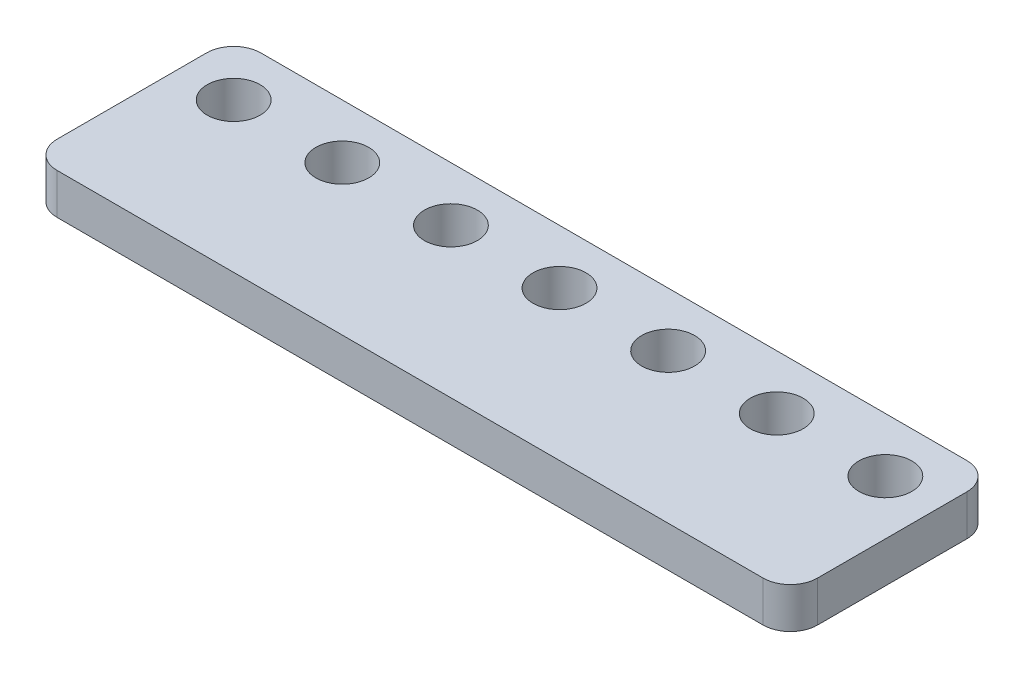
ISO-10303-21;
HEADER;
FILE_DESCRIPTION(('STEP AP214'),'2;1');
FILE_NAME('part.step','',(''),(''),'','','');
FILE_SCHEMA(('AUTOMOTIVE_DESIGN { 1 0 10303 214 1 1 1 1 }'));
ENDSEC;
DATA;
#1=APPLICATION_CONTEXT('core data for automotive mechanical design processes');
#2=APPLICATION_PROTOCOL_DEFINITION('international standard','automotive_design',2000,#1);
#3=PRODUCT_CONTEXT('',#1,'mechanical');
#4=PRODUCT('Part','Part','',(#3));
#5=PRODUCT_RELATED_PRODUCT_CATEGORY('part','',(#4));
#6=PRODUCT_DEFINITION_FORMATION('','',#4);
#7=PRODUCT_DEFINITION_CONTEXT('part definition',#1,'design');
#8=PRODUCT_DEFINITION('design','',#6,#7);
#9=PRODUCT_DEFINITION_SHAPE('','',#8);
#10=(LENGTH_UNIT() NAMED_UNIT(*) SI_UNIT(.MILLI.,.METRE.));
#11=(NAMED_UNIT(*) PLANE_ANGLE_UNIT() SI_UNIT($,.RADIAN.));
#12=(NAMED_UNIT(*) SI_UNIT($,.STERADIAN.) SOLID_ANGLE_UNIT());
#13=UNCERTAINTY_MEASURE_WITH_UNIT(LENGTH_MEASURE(1.E-05),#10,'distance_accuracy_value','');
#14=(GEOMETRIC_REPRESENTATION_CONTEXT(3) GLOBAL_UNCERTAINTY_ASSIGNED_CONTEXT((#13)) GLOBAL_UNIT_ASSIGNED_CONTEXT((#10,
#11,#12)) REPRESENTATION_CONTEXT('',''));
#15=CARTESIAN_POINT('',(0.,0.,0.));
#16=DIRECTION('',(0.,0.,1.));
#17=DIRECTION('',(1.,0.,0.));
#18=AXIS2_PLACEMENT_3D('',#15,#16,#17);
#19=CARTESIAN_POINT('',(-2.,3.,13.));
#20=DIRECTION('',(0.,-1.,0.));
#21=DIRECTION('',(0.,0.,-1.));
#22=AXIS2_PLACEMENT_3D('',#19,#20,#21);
#23=CYLINDRICAL_SURFACE('',#22,2.);
#24=CARTESIAN_POINT('',(-2.,0.,13.));
#25=DIRECTION('',(0.,1.,0.));
#26=DIRECTION('',(0.,0.,1.));
#27=AXIS2_PLACEMENT_3D('',#24,#25,#26);
#28=CIRCLE('',#27,2.);
#29=CARTESIAN_POINT('',(-2.,0.,15.));
#30=VERTEX_POINT('',#29);
#31=CARTESIAN_POINT('',(0.,0.,13.));
#32=VERTEX_POINT('',#31);
#33=EDGE_CURVE('E128',#30,#32,#28,.T.);
#34=ORIENTED_EDGE('',*,*,#33,.T.);
#35=DIRECTION('',(0.,-1.,0.));
#36=VECTOR('',#35,1.);
#37=CARTESIAN_POINT('',(0.,3.,13.));
#38=LINE('',#37,#36);
#39=CARTESIAN_POINT('',(0.,3.,13.));
#40=VERTEX_POINT('',#39);
#41=EDGE_CURVE('E11',#40,#32,#38,.T.);
#42=ORIENTED_EDGE('',*,*,#41,.F.);
#43=CARTESIAN_POINT('',(-2.,3.,13.));
#44=DIRECTION('',(0.,1.,0.));
#45=DIRECTION('',(0.,0.,1.));
#46=AXIS2_PLACEMENT_3D('',#43,#44,#45);
#47=CIRCLE('',#46,2.);
#48=CARTESIAN_POINT('',(-2.,3.,15.));
#49=VERTEX_POINT('',#48);
#50=EDGE_CURVE('E143',#49,#40,#47,.T.);
#51=ORIENTED_EDGE('',*,*,#50,.F.);
#52=DIRECTION('',(0.,-1.,0.));
#53=VECTOR('',#52,1.);
#54=CARTESIAN_POINT('',(-2.,3.,15.));
#55=LINE('',#54,#53);
#56=EDGE_CURVE('E124',#49,#30,#55,.T.);
#57=ORIENTED_EDGE('',*,*,#56,.T.);
#58=EDGE_LOOP('',(#34,#42,#51,#57));
#59=FACE_BOUND('',#58,.T.);
#60=ADVANCED_FACE('F32',(#59),#23,.T.);
#61=CARTESIAN_POINT('',(0.,3.,2.));
#62=DIRECTION('',(-1.,0.,0.));
#63=DIRECTION('',(0.,0.,1.));
#64=AXIS2_PLACEMENT_3D('',#61,#62,#63);
#65=PLANE('',#64);
#66=DIRECTION('',(0.,0.,-1.));
#67=VECTOR('',#66,1.);
#68=CARTESIAN_POINT('',(0.,0.,2.));
#69=LINE('',#68,#67);
#70=CARTESIAN_POINT('',(0.,0.,2.));
#71=VERTEX_POINT('',#70);
#72=EDGE_CURVE('E131',#32,#71,#69,.T.);
#73=ORIENTED_EDGE('',*,*,#72,.T.);
#74=DIRECTION('',(0.,-1.,0.));
#75=VECTOR('',#74,1.);
#76=CARTESIAN_POINT('',(0.,3.,2.));
#77=LINE('',#76,#75);
#78=CARTESIAN_POINT('',(0.,3.,2.));
#79=VERTEX_POINT('',#78);
#80=EDGE_CURVE('E40',#79,#71,#77,.T.);
#81=ORIENTED_EDGE('',*,*,#80,.F.);
#82=DIRECTION('',(0.,0.,-1.));
#83=VECTOR('',#82,1.);
#84=CARTESIAN_POINT('',(0.,3.,2.));
#85=LINE('',#84,#83);
#86=EDGE_CURVE('E91',#40,#79,#85,.T.);
#87=ORIENTED_EDGE('',*,*,#86,.F.);
#88=ORIENTED_EDGE('',*,*,#41,.T.);
#89=EDGE_LOOP('',(#73,#81,#87,#88));
#90=FACE_BOUND('',#89,.T.);
#91=ADVANCED_FACE('F259',(#90),#65,.F.);
#92=CARTESIAN_POINT('',(-2.,3.,2.));
#93=DIRECTION('',(0.,-1.,0.));
#94=DIRECTION('',(0.,0.,-1.));
#95=AXIS2_PLACEMENT_3D('',#92,#93,#94);
#96=CYLINDRICAL_SURFACE('',#95,2.);
#97=CARTESIAN_POINT('',(-2.,0.,2.));
#98=DIRECTION('',(0.,1.,0.));
#99=DIRECTION('',(0.,0.,-1.));
#100=AXIS2_PLACEMENT_3D('',#97,#98,#99);
#101=CIRCLE('',#100,2.);
#102=CARTESIAN_POINT('',(-2.,0.,0.));
#103=VERTEX_POINT('',#102);
#104=EDGE_CURVE('E134',#71,#103,#101,.T.);
#105=ORIENTED_EDGE('',*,*,#104,.T.);
#106=DIRECTION('',(0.,-1.,0.));
#107=VECTOR('',#106,1.);
#108=CARTESIAN_POINT('',(-2.,3.,0.));
#109=LINE('',#108,#107);
#110=CARTESIAN_POINT('',(-2.,3.,0.));
#111=VERTEX_POINT('',#110);
#112=EDGE_CURVE('E150',#111,#103,#109,.T.);
#113=ORIENTED_EDGE('',*,*,#112,.F.);
#114=CARTESIAN_POINT('',(-2.,3.,2.));
#115=DIRECTION('',(0.,1.,0.));
#116=DIRECTION('',(0.,0.,-1.));
#117=AXIS2_PLACEMENT_3D('',#114,#115,#116);
#118=CIRCLE('',#117,2.);
#119=EDGE_CURVE('E158',#79,#111,#118,.T.);
#120=ORIENTED_EDGE('',*,*,#119,.F.);
#121=ORIENTED_EDGE('',*,*,#80,.T.);
#122=EDGE_LOOP('',(#105,#113,#120,#121));
#123=FACE_BOUND('',#122,.T.);
#124=ADVANCED_FACE('F156',(#123),#96,.T.);
#125=CARTESIAN_POINT('',(-54.,3.,0.));
#126=DIRECTION('',(0.,0.,1.));
#127=DIRECTION('',(1.,0.,0.));
#128=AXIS2_PLACEMENT_3D('',#125,#126,#127);
#129=PLANE('',#128);
#130=DIRECTION('',(-1.,0.,0.));
#131=VECTOR('',#130,1.);
#132=CARTESIAN_POINT('',(-54.,0.,0.));
#133=LINE('',#132,#131);
#134=CARTESIAN_POINT('',(-54.,0.,0.));
#135=VERTEX_POINT('',#134);
#136=EDGE_CURVE('E136',#103,#135,#133,.T.);
#137=ORIENTED_EDGE('',*,*,#136,.T.);
#138=DIRECTION('',(0.,-1.,0.));
#139=VECTOR('',#138,1.);
#140=CARTESIAN_POINT('',(-54.,3.,0.));
#141=LINE('',#140,#139);
#142=CARTESIAN_POINT('',(-54.,3.,0.));
#143=VERTEX_POINT('',#142);
#144=EDGE_CURVE('E147',#143,#135,#141,.T.);
#145=ORIENTED_EDGE('',*,*,#144,.F.);
#146=DIRECTION('',(-1.,0.,0.));
#147=VECTOR('',#146,1.);
#148=CARTESIAN_POINT('',(-54.,3.,0.));
#149=LINE('',#148,#147);
#150=EDGE_CURVE('E170',#111,#143,#149,.T.);
#151=ORIENTED_EDGE('',*,*,#150,.F.);
#152=ORIENTED_EDGE('',*,*,#112,.T.);
#153=EDGE_LOOP('',(#137,#145,#151,#152));
#154=FACE_BOUND('',#153,.T.);
#155=ADVANCED_FACE('F166',(#154),#129,.F.);
#156=CARTESIAN_POINT('',(-54.,3.,2.));
#157=DIRECTION('',(0.,-1.,0.));
#158=DIRECTION('',(0.,0.,-1.));
#159=AXIS2_PLACEMENT_3D('',#156,#157,#158);
#160=CYLINDRICAL_SURFACE('',#159,2.);
#161=CARTESIAN_POINT('',(-54.,0.,2.));
#162=DIRECTION('',(0.,1.,0.));
#163=DIRECTION('',(0.,0.,1.));
#164=AXIS2_PLACEMENT_3D('',#161,#162,#163);
#165=CIRCLE('',#164,2.);
#166=CARTESIAN_POINT('',(-56.,0.,2.));
#167=VERTEX_POINT('',#166);
#168=EDGE_CURVE('E138',#135,#167,#165,.T.);
#169=ORIENTED_EDGE('',*,*,#168,.T.);
#170=DIRECTION('',(0.,-1.,0.));
#171=VECTOR('',#170,1.);
#172=CARTESIAN_POINT('',(-56.,3.,2.));
#173=LINE('',#172,#171);
#174=CARTESIAN_POINT('',(-56.,3.,2.));
#175=VERTEX_POINT('',#174);
#176=EDGE_CURVE('E119',#175,#167,#173,.T.);
#177=ORIENTED_EDGE('',*,*,#176,.F.);
#178=CARTESIAN_POINT('',(-54.,3.,2.));
#179=DIRECTION('',(0.,1.,0.));
#180=DIRECTION('',(0.,0.,1.));
#181=AXIS2_PLACEMENT_3D('',#178,#179,#180);
#182=CIRCLE('',#181,2.);
#183=EDGE_CURVE('E110',#143,#175,#182,.T.);
#184=ORIENTED_EDGE('',*,*,#183,.F.);
#185=ORIENTED_EDGE('',*,*,#144,.T.);
#186=EDGE_LOOP('',(#169,#177,#184,#185));
#187=FACE_BOUND('',#186,.T.);
#188=ADVANCED_FACE('F169',(#187),#160,.T.);
#189=CARTESIAN_POINT('',(-56.,3.,2.));
#190=DIRECTION('',(1.,0.,0.));
#191=DIRECTION('',(0.,0.,-1.));
#192=AXIS2_PLACEMENT_3D('',#189,#190,#191);
#193=PLANE('',#192);
#194=DIRECTION('',(0.,0.,1.));
#195=VECTOR('',#194,1.);
#196=CARTESIAN_POINT('',(-56.,0.,2.));
#197=LINE('',#196,#195);
#198=CARTESIAN_POINT('',(-56.,0.,13.));
#199=VERTEX_POINT('',#198);
#200=EDGE_CURVE('E118',#167,#199,#197,.T.);
#201=ORIENTED_EDGE('',*,*,#200,.T.);
#202=DIRECTION('',(0.,-1.,0.));
#203=VECTOR('',#202,1.);
#204=CARTESIAN_POINT('',(-56.,3.,13.));
#205=LINE('',#204,#203);
#206=CARTESIAN_POINT('',(-56.,3.,13.));
#207=VERTEX_POINT('',#206);
#208=EDGE_CURVE('E115',#207,#199,#205,.T.);
#209=ORIENTED_EDGE('',*,*,#208,.F.);
#210=DIRECTION('',(0.,0.,1.));
#211=VECTOR('',#210,1.);
#212=CARTESIAN_POINT('',(-56.,3.,2.));
#213=LINE('',#212,#211);
#214=EDGE_CURVE('E104',#175,#207,#213,.T.);
#215=ORIENTED_EDGE('',*,*,#214,.F.);
#216=ORIENTED_EDGE('',*,*,#176,.T.);
#217=EDGE_LOOP('',(#201,#209,#215,#216));
#218=FACE_BOUND('',#217,.T.);
#219=ADVANCED_FACE('F116',(#218),#193,.F.);
#220=CARTESIAN_POINT('',(-54.,3.,13.));
#221=DIRECTION('',(0.,-1.,0.));
#222=DIRECTION('',(0.,0.,-1.));
#223=AXIS2_PLACEMENT_3D('',#220,#221,#222);
#224=CYLINDRICAL_SURFACE('',#223,2.);
#225=CARTESIAN_POINT('',(-54.,0.,13.));
#226=DIRECTION('',(0.,1.,0.));
#227=DIRECTION('',(0.,0.,1.));
#228=AXIS2_PLACEMENT_3D('',#225,#226,#227);
#229=CIRCLE('',#228,2.);
#230=CARTESIAN_POINT('',(-54.,0.,15.));
#231=VERTEX_POINT('',#230);
#232=EDGE_CURVE('E77',#199,#231,#229,.T.);
#233=ORIENTED_EDGE('',*,*,#232,.T.);
#234=DIRECTION('',(0.,-1.,0.));
#235=VECTOR('',#234,1.);
#236=CARTESIAN_POINT('',(-54.,3.,15.));
#237=LINE('',#236,#235);
#238=CARTESIAN_POINT('',(-54.,3.,15.));
#239=VERTEX_POINT('',#238);
#240=EDGE_CURVE('E120',#239,#231,#237,.T.);
#241=ORIENTED_EDGE('',*,*,#240,.F.);
#242=CARTESIAN_POINT('',(-54.,3.,13.));
#243=DIRECTION('',(0.,1.,0.));
#244=DIRECTION('',(0.,0.,1.));
#245=AXIS2_PLACEMENT_3D('',#242,#243,#244);
#246=CIRCLE('',#245,2.);
#247=EDGE_CURVE('E108',#207,#239,#246,.T.);
#248=ORIENTED_EDGE('',*,*,#247,.F.);
#249=ORIENTED_EDGE('',*,*,#208,.T.);
#250=EDGE_LOOP('',(#233,#241,#248,#249));
#251=FACE_BOUND('',#250,.T.);
#252=ADVANCED_FACE('F122',(#251),#224,.T.);
#253=CARTESIAN_POINT('',(-54.,3.,15.));
#254=DIRECTION('',(0.,0.,-1.));
#255=DIRECTION('',(-1.,0.,0.));
#256=AXIS2_PLACEMENT_3D('',#253,#254,#255);
#257=PLANE('',#256);
#258=DIRECTION('',(1.,0.,0.));
#259=VECTOR('',#258,1.);
#260=CARTESIAN_POINT('',(-54.,0.,15.));
#261=LINE('',#260,#259);
#262=EDGE_CURVE('E83',#231,#30,#261,.T.);
#263=ORIENTED_EDGE('',*,*,#262,.T.);
#264=ORIENTED_EDGE('',*,*,#56,.F.);
#265=DIRECTION('',(1.,0.,0.));
#266=VECTOR('',#265,1.);
#267=CARTESIAN_POINT('',(-54.,3.,15.));
#268=LINE('',#267,#266);
#269=EDGE_CURVE('E48',#239,#49,#268,.T.);
#270=ORIENTED_EDGE('',*,*,#269,.F.);
#271=ORIENTED_EDGE('',*,*,#240,.T.);
#272=EDGE_LOOP('',(#263,#264,#270,#271));
#273=FACE_BOUND('',#272,.T.);
#274=ADVANCED_FACE('F229',(#273),#257,.F.);
#275=CARTESIAN_POINT('',(-2.,3.,13.));
#276=DIRECTION('',(0.,1.,0.));
#277=DIRECTION('',(0.,0.,1.));
#278=AXIS2_PLACEMENT_3D('',#275,#276,#277);
#279=PLANE('',#278);
#280=CARTESIAN_POINT('',(-4.,3.,4.));
#281=DIRECTION('',(0.,1.,0.));
#282=DIRECTION('',(0.,0.,1.));
#283=AXIS2_PLACEMENT_3D('',#280,#281,#282);
#284=CIRCLE('',#283,1.95);
#285=CARTESIAN_POINT('',(-4.,3.,5.95));
#286=VERTEX_POINT('',#285);
#287=EDGE_CURVE('E183',#286,#286,#284,.T.);
#288=ORIENTED_EDGE('',*,*,#287,.F.);
#289=EDGE_LOOP('',(#288));
#290=FACE_BOUND('',#289,.T.);
#291=CARTESIAN_POINT('',(-20.,3.,4.));
#292=DIRECTION('',(0.,1.,0.));
#293=DIRECTION('',(0.,0.,1.));
#294=AXIS2_PLACEMENT_3D('',#291,#292,#293);
#295=CIRCLE('',#294,1.95);
#296=CARTESIAN_POINT('',(-20.,3.,5.95));
#297=VERTEX_POINT('',#296);
#298=EDGE_CURVE('E208',#297,#297,#295,.T.);
#299=ORIENTED_EDGE('',*,*,#298,.F.);
#300=EDGE_LOOP('',(#299));
#301=FACE_BOUND('',#300,.T.);
#302=CARTESIAN_POINT('',(-12.,3.,4.));
#303=DIRECTION('',(0.,1.,0.));
#304=DIRECTION('',(0.,0.,1.));
#305=AXIS2_PLACEMENT_3D('',#302,#303,#304);
#306=CIRCLE('',#305,1.95);
#307=CARTESIAN_POINT('',(-12.,3.,5.95));
#308=VERTEX_POINT('',#307);
#309=EDGE_CURVE('E176',#308,#308,#306,.T.);
#310=ORIENTED_EDGE('',*,*,#309,.F.);
#311=EDGE_LOOP('',(#310));
#312=FACE_BOUND('',#311,.T.);
#313=CARTESIAN_POINT('',(-52.,3.,4.00000000000001));
#314=DIRECTION('',(0.,1.,0.));
#315=DIRECTION('',(0.,0.,1.));
#316=AXIS2_PLACEMENT_3D('',#313,#314,#315);
#317=CIRCLE('',#316,1.95);
#318=CARTESIAN_POINT('',(-52.,3.,5.95000000000001));
#319=VERTEX_POINT('',#318);
#320=EDGE_CURVE('E203',#319,#319,#317,.T.);
#321=ORIENTED_EDGE('',*,*,#320,.F.);
#322=EDGE_LOOP('',(#321));
#323=FACE_BOUND('',#322,.T.);
#324=CARTESIAN_POINT('',(-44.,3.,4.00000000000001));
#325=DIRECTION('',(0.,1.,0.));
#326=DIRECTION('',(0.,0.,1.));
#327=AXIS2_PLACEMENT_3D('',#324,#325,#326);
#328=CIRCLE('',#327,1.95);
#329=CARTESIAN_POINT('',(-44.,3.,5.95));
#330=VERTEX_POINT('',#329);
#331=EDGE_CURVE('E197',#330,#330,#328,.T.);
#332=ORIENTED_EDGE('',*,*,#331,.F.);
#333=EDGE_LOOP('',(#332));
#334=FACE_BOUND('',#333,.T.);
#335=CARTESIAN_POINT('',(-36.,3.,4.));
#336=DIRECTION('',(0.,1.,0.));
#337=DIRECTION('',(0.,0.,1.));
#338=AXIS2_PLACEMENT_3D('',#335,#336,#337);
#339=CIRCLE('',#338,1.95);
#340=CARTESIAN_POINT('',(-36.,3.,5.95));
#341=VERTEX_POINT('',#340);
#342=EDGE_CURVE('E191',#341,#341,#339,.T.);
#343=ORIENTED_EDGE('',*,*,#342,.F.);
#344=EDGE_LOOP('',(#343));
#345=FACE_BOUND('',#344,.T.);
#346=CARTESIAN_POINT('',(-28.,3.,4.));
#347=DIRECTION('',(0.,1.,0.));
#348=DIRECTION('',(0.,0.,1.));
#349=AXIS2_PLACEMENT_3D('',#346,#347,#348);
#350=CIRCLE('',#349,1.95);
#351=CARTESIAN_POINT('',(-28.,3.,5.95));
#352=VERTEX_POINT('',#351);
#353=EDGE_CURVE('E184',#352,#352,#350,.T.);
#354=ORIENTED_EDGE('',*,*,#353,.F.);
#355=EDGE_LOOP('',(#354));
#356=FACE_BOUND('',#355,.T.);
#357=ORIENTED_EDGE('',*,*,#50,.T.);
#358=ORIENTED_EDGE('',*,*,#86,.T.);
#359=ORIENTED_EDGE('',*,*,#119,.T.);
#360=ORIENTED_EDGE('',*,*,#150,.T.);
#361=ORIENTED_EDGE('',*,*,#183,.T.);
#362=ORIENTED_EDGE('',*,*,#214,.T.);
#363=ORIENTED_EDGE('',*,*,#247,.T.);
#364=ORIENTED_EDGE('',*,*,#269,.T.);
#365=EDGE_LOOP('',(#357,#358,#359,#360,#361,#362,#363,#364));
#366=FACE_BOUND('',#365,.T.);
#367=ADVANCED_FACE('F106',(#290,#301,#312,#323,#334,#345,#356,#366),#279,.T.);
#368=CARTESIAN_POINT('',(-2.,0.,13.));
#369=DIRECTION('',(0.,1.,0.));
#370=DIRECTION('',(0.,0.,1.));
#371=AXIS2_PLACEMENT_3D('',#368,#369,#370);
#372=PLANE('',#371);
#373=CARTESIAN_POINT('',(-4.,0.,4.));
#374=DIRECTION('',(0.,1.,0.));
#375=DIRECTION('',(0.,0.,1.));
#376=AXIS2_PLACEMENT_3D('',#373,#374,#375);
#377=CIRCLE('',#376,1.95);
#378=CARTESIAN_POINT('',(-4.,0.,5.95));
#379=VERTEX_POINT('',#378);
#380=EDGE_CURVE('E132',#379,#379,#377,.T.);
#381=ORIENTED_EDGE('',*,*,#380,.T.);
#382=EDGE_LOOP('',(#381));
#383=FACE_BOUND('',#382,.T.);
#384=CARTESIAN_POINT('',(-20.,0.,4.));
#385=DIRECTION('',(0.,1.,0.));
#386=DIRECTION('',(0.,0.,1.));
#387=AXIS2_PLACEMENT_3D('',#384,#385,#386);
#388=CIRCLE('',#387,1.95);
#389=CARTESIAN_POINT('',(-20.,0.,5.95));
#390=VERTEX_POINT('',#389);
#391=EDGE_CURVE('E188',#390,#390,#388,.T.);
#392=ORIENTED_EDGE('',*,*,#391,.T.);
#393=EDGE_LOOP('',(#392));
#394=FACE_BOUND('',#393,.T.);
#395=CARTESIAN_POINT('',(-12.,0.,4.));
#396=DIRECTION('',(0.,1.,0.));
#397=DIRECTION('',(0.,0.,1.));
#398=AXIS2_PLACEMENT_3D('',#395,#396,#397);
#399=CIRCLE('',#398,1.95);
#400=CARTESIAN_POINT('',(-12.,0.,5.95));
#401=VERTEX_POINT('',#400);
#402=EDGE_CURVE('E179',#401,#401,#399,.T.);
#403=ORIENTED_EDGE('',*,*,#402,.T.);
#404=EDGE_LOOP('',(#403));
#405=FACE_BOUND('',#404,.T.);
#406=CARTESIAN_POINT('',(-52.,0.,4.00000000000001));
#407=DIRECTION('',(0.,1.,0.));
#408=DIRECTION('',(0.,0.,1.));
#409=AXIS2_PLACEMENT_3D('',#406,#407,#408);
#410=CIRCLE('',#409,1.95);
#411=CARTESIAN_POINT('',(-52.,0.,5.95000000000001));
#412=VERTEX_POINT('',#411);
#413=EDGE_CURVE('E180',#412,#412,#410,.T.);
#414=ORIENTED_EDGE('',*,*,#413,.T.);
#415=EDGE_LOOP('',(#414));
#416=FACE_BOUND('',#415,.T.);
#417=CARTESIAN_POINT('',(-44.,0.,4.00000000000001));
#418=DIRECTION('',(0.,1.,0.));
#419=DIRECTION('',(0.,0.,1.));
#420=AXIS2_PLACEMENT_3D('',#417,#418,#419);
#421=CIRCLE('',#420,1.95);
#422=CARTESIAN_POINT('',(-44.,0.,5.95));
#423=VERTEX_POINT('',#422);
#424=EDGE_CURVE('E200',#423,#423,#421,.T.);
#425=ORIENTED_EDGE('',*,*,#424,.T.);
#426=EDGE_LOOP('',(#425));
#427=FACE_BOUND('',#426,.T.);
#428=CARTESIAN_POINT('',(-36.,0.,4.));
#429=DIRECTION('',(0.,1.,0.));
#430=DIRECTION('',(0.,0.,1.));
#431=AXIS2_PLACEMENT_3D('',#428,#429,#430);
#432=CIRCLE('',#431,1.95);
#433=CARTESIAN_POINT('',(-36.,0.,5.95));
#434=VERTEX_POINT('',#433);
#435=EDGE_CURVE('E194',#434,#434,#432,.T.);
#436=ORIENTED_EDGE('',*,*,#435,.T.);
#437=EDGE_LOOP('',(#436));
#438=FACE_BOUND('',#437,.T.);
#439=CARTESIAN_POINT('',(-28.,0.,4.));
#440=DIRECTION('',(0.,1.,0.));
#441=DIRECTION('',(0.,0.,1.));
#442=AXIS2_PLACEMENT_3D('',#439,#440,#441);
#443=CIRCLE('',#442,1.95);
#444=CARTESIAN_POINT('',(-28.,0.,5.95));
#445=VERTEX_POINT('',#444);
#446=EDGE_CURVE('E187',#445,#445,#443,.T.);
#447=ORIENTED_EDGE('',*,*,#446,.T.);
#448=EDGE_LOOP('',(#447));
#449=FACE_BOUND('',#448,.T.);
#450=ORIENTED_EDGE('',*,*,#33,.F.);
#451=ORIENTED_EDGE('',*,*,#262,.F.);
#452=ORIENTED_EDGE('',*,*,#232,.F.);
#453=ORIENTED_EDGE('',*,*,#200,.F.);
#454=ORIENTED_EDGE('',*,*,#168,.F.);
#455=ORIENTED_EDGE('',*,*,#136,.F.);
#456=ORIENTED_EDGE('',*,*,#104,.F.);
#457=ORIENTED_EDGE('',*,*,#72,.F.);
#458=EDGE_LOOP('',(#450,#451,#452,#453,#454,#455,#456,#457));
#459=FACE_BOUND('',#458,.T.);
#460=ADVANCED_FACE('F162',(#383,#394,#405,#416,#427,#438,#449,#459),#372,.F.);
#461=CARTESIAN_POINT('',(-28.,0.,4.));
#462=DIRECTION('',(0.,1.,0.));
#463=DIRECTION('',(0.,0.,1.));
#464=AXIS2_PLACEMENT_3D('',#461,#462,#463);
#465=CYLINDRICAL_SURFACE('',#464,1.95);
#466=ORIENTED_EDGE('',*,*,#446,.F.);
#467=EDGE_LOOP('',(#466));
#468=FACE_BOUND('',#467,.T.);
#469=ORIENTED_EDGE('',*,*,#353,.T.);
#470=EDGE_LOOP('',(#469));
#471=FACE_BOUND('',#470,.T.);
#472=ADVANCED_FACE('F243',(#468,#471),#465,.F.);
#473=CARTESIAN_POINT('',(-36.,0.,4.));
#474=DIRECTION('',(0.,1.,0.));
#475=DIRECTION('',(0.,0.,1.));
#476=AXIS2_PLACEMENT_3D('',#473,#474,#475);
#477=CYLINDRICAL_SURFACE('',#476,1.95);
#478=ORIENTED_EDGE('',*,*,#435,.F.);
#479=EDGE_LOOP('',(#478));
#480=FACE_BOUND('',#479,.T.);
#481=ORIENTED_EDGE('',*,*,#342,.T.);
#482=EDGE_LOOP('',(#481));
#483=FACE_BOUND('',#482,.T.);
#484=ADVANCED_FACE('F245',(#480,#483),#477,.F.);
#485=CARTESIAN_POINT('',(-44.,0.,4.00000000000001));
#486=DIRECTION('',(0.,1.,0.));
#487=DIRECTION('',(0.,0.,1.));
#488=AXIS2_PLACEMENT_3D('',#485,#486,#487);
#489=CYLINDRICAL_SURFACE('',#488,1.95);
#490=ORIENTED_EDGE('',*,*,#424,.F.);
#491=EDGE_LOOP('',(#490));
#492=FACE_BOUND('',#491,.T.);
#493=ORIENTED_EDGE('',*,*,#331,.T.);
#494=EDGE_LOOP('',(#493));
#495=FACE_BOUND('',#494,.T.);
#496=ADVANCED_FACE('F252',(#492,#495),#489,.F.);
#497=CARTESIAN_POINT('',(-52.,0.,4.00000000000001));
#498=DIRECTION('',(0.,1.,0.));
#499=DIRECTION('',(0.,0.,1.));
#500=AXIS2_PLACEMENT_3D('',#497,#498,#499);
#501=CYLINDRICAL_SURFACE('',#500,1.95);
#502=ORIENTED_EDGE('',*,*,#413,.F.);
#503=EDGE_LOOP('',(#502));
#504=FACE_BOUND('',#503,.T.);
#505=ORIENTED_EDGE('',*,*,#320,.T.);
#506=EDGE_LOOP('',(#505));
#507=FACE_BOUND('',#506,.T.);
#508=ADVANCED_FACE('F335',(#504,#507),#501,.F.);
#509=CARTESIAN_POINT('',(-12.,0.,4.));
#510=DIRECTION('',(0.,1.,0.));
#511=DIRECTION('',(0.,0.,1.));
#512=AXIS2_PLACEMENT_3D('',#509,#510,#511);
#513=CYLINDRICAL_SURFACE('',#512,1.95);
#514=ORIENTED_EDGE('',*,*,#402,.F.);
#515=EDGE_LOOP('',(#514));
#516=FACE_BOUND('',#515,.T.);
#517=ORIENTED_EDGE('',*,*,#309,.T.);
#518=EDGE_LOOP('',(#517));
#519=FACE_BOUND('',#518,.T.);
#520=ADVANCED_FACE('F345',(#516,#519),#513,.F.);
#521=CARTESIAN_POINT('',(-20.,0.,4.));
#522=DIRECTION('',(0.,1.,0.));
#523=DIRECTION('',(0.,0.,1.));
#524=AXIS2_PLACEMENT_3D('',#521,#522,#523);
#525=CYLINDRICAL_SURFACE('',#524,1.95);
#526=ORIENTED_EDGE('',*,*,#391,.F.);
#527=EDGE_LOOP('',(#526));
#528=FACE_BOUND('',#527,.T.);
#529=ORIENTED_EDGE('',*,*,#298,.T.);
#530=EDGE_LOOP('',(#529));
#531=FACE_BOUND('',#530,.T.);
#532=ADVANCED_FACE('F223',(#528,#531),#525,.F.);
#533=CARTESIAN_POINT('',(-4.,0.,4.));
#534=DIRECTION('',(0.,1.,0.));
#535=DIRECTION('',(0.,0.,1.));
#536=AXIS2_PLACEMENT_3D('',#533,#534,#535);
#537=CYLINDRICAL_SURFACE('',#536,1.95);
#538=ORIENTED_EDGE('',*,*,#380,.F.);
#539=EDGE_LOOP('',(#538));
#540=FACE_BOUND('',#539,.T.);
#541=ORIENTED_EDGE('',*,*,#287,.T.);
#542=EDGE_LOOP('',(#541));
#543=FACE_BOUND('',#542,.T.);
#544=ADVANCED_FACE('F220',(#540,#543),#537,.F.);
#545=CLOSED_SHELL('',(#60,#91,#124,#155,#188,#219,#252,#274,#367,#460,#472,#484,#496,#508,#520,
#532,#544));
#546=MANIFOLD_SOLID_BREP('B2',#545);
#547=ADVANCED_BREP_SHAPE_REPRESENTATION('',(#18,#546),#14);
#548=SHAPE_DEFINITION_REPRESENTATION(#9,#547);
ENDSEC;
END-ISO-10303-21;
